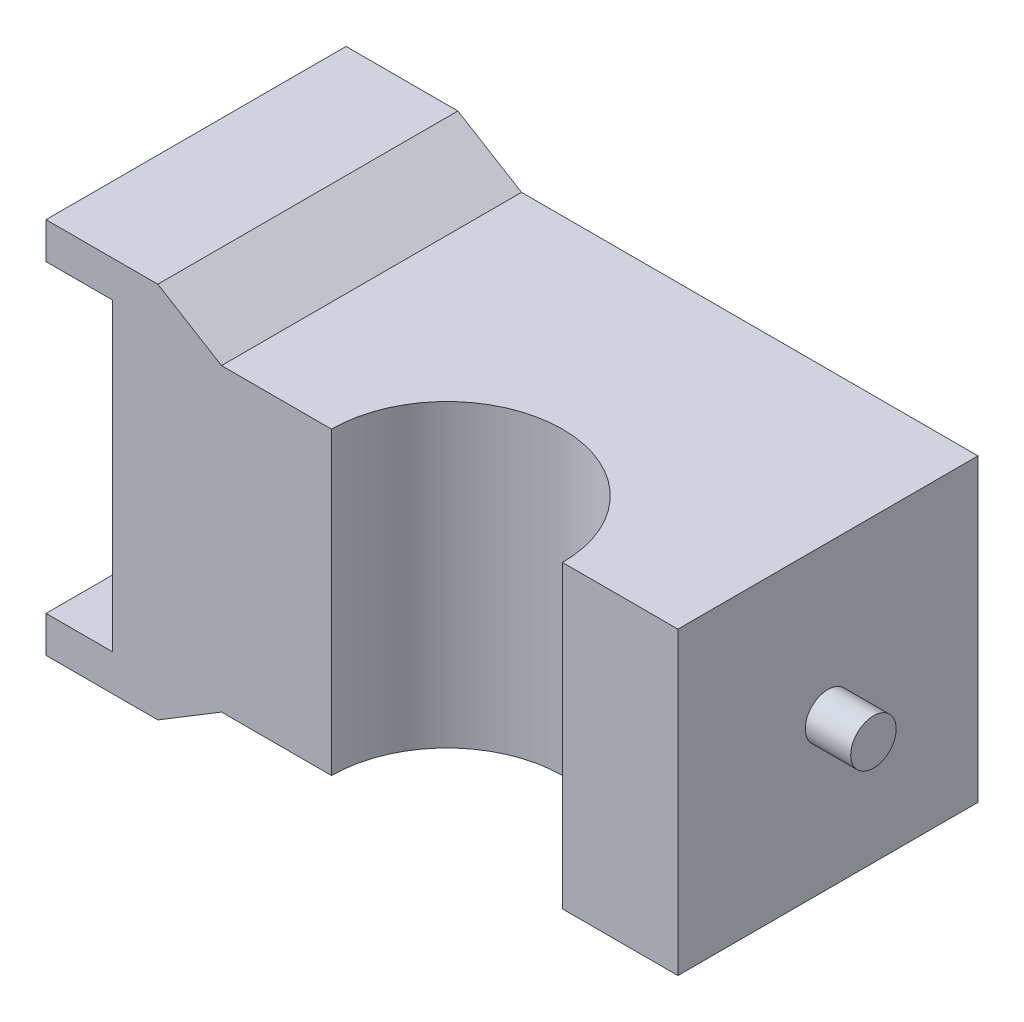
ISO-10303-21;
HEADER;
FILE_DESCRIPTION(('STEP AP214'),'2;1');
FILE_NAME('part.step','',(''),(''),'','','');
FILE_SCHEMA(('AUTOMOTIVE_DESIGN { 1 0 10303 214 1 1 1 1 }'));
ENDSEC;
DATA;
#1=APPLICATION_CONTEXT('core data for automotive mechanical design processes');
#2=APPLICATION_PROTOCOL_DEFINITION('international standard','automotive_design',2000,#1);
#3=PRODUCT_CONTEXT('',#1,'mechanical');
#4=PRODUCT('Part','Part','',(#3));
#5=PRODUCT_RELATED_PRODUCT_CATEGORY('part','',(#4));
#6=PRODUCT_DEFINITION_FORMATION('','',#4);
#7=PRODUCT_DEFINITION_CONTEXT('part definition',#1,'design');
#8=PRODUCT_DEFINITION('design','',#6,#7);
#9=PRODUCT_DEFINITION_SHAPE('','',#8);
#10=(LENGTH_UNIT() NAMED_UNIT(*) SI_UNIT(.MILLI.,.METRE.));
#11=(NAMED_UNIT(*) PLANE_ANGLE_UNIT() SI_UNIT($,.RADIAN.));
#12=(NAMED_UNIT(*) SI_UNIT($,.STERADIAN.) SOLID_ANGLE_UNIT());
#13=UNCERTAINTY_MEASURE_WITH_UNIT(LENGTH_MEASURE(1.E-05),#10,'distance_accuracy_value','');
#14=(GEOMETRIC_REPRESENTATION_CONTEXT(3) GLOBAL_UNCERTAINTY_ASSIGNED_CONTEXT((#13)) GLOBAL_UNIT_ASSIGNED_CONTEXT((#10,
#11,#12)) REPRESENTATION_CONTEXT('',''));
#15=CARTESIAN_POINT('',(0.,0.,0.));
#16=DIRECTION('',(0.,0.,1.));
#17=DIRECTION('',(1.,0.,0.));
#18=AXIS2_PLACEMENT_3D('',#15,#16,#17);
#19=CARTESIAN_POINT('',(0.,0.,16.5));
#20=DIRECTION('',(0.,0.,-1.));
#21=DIRECTION('',(-1.,0.,0.));
#22=AXIS2_PLACEMENT_3D('',#19,#20,#21);
#23=PLANE('',#22);
#24=DIRECTION('',(0.,-1.,0.));
#25=VECTOR('',#24,1.);
#26=CARTESIAN_POINT('',(12.4,20.75,16.5));
#27=LINE('',#26,#25);
#28=CARTESIAN_POINT('',(12.4,-16.5,16.5));
#29=VERTEX_POINT('',#28);
#30=CARTESIAN_POINT('',(12.4,16.5,16.5));
#31=VERTEX_POINT('',#30);
#32=EDGE_CURVE('E11',#29,#31,#27,.F.);
#33=ORIENTED_EDGE('',*,*,#32,.F.);
#34=DIRECTION('',(1.,0.,0.));
#35=VECTOR('',#34,1.);
#36=CARTESIAN_POINT('',(25.1,-16.5,16.5));
#37=LINE('',#36,#35);
#38=CARTESIAN_POINT('',(25.1,-16.5,16.5));
#39=VERTEX_POINT('',#38);
#40=EDGE_CURVE('E55',#29,#39,#37,.T.);
#41=ORIENTED_EDGE('',*,*,#40,.T.);
#42=DIRECTION('',(0.,1.,0.));
#43=VECTOR('',#42,1.);
#44=CARTESIAN_POINT('',(25.1,16.5,16.5));
#45=LINE('',#44,#43);
#46=CARTESIAN_POINT('',(25.1,16.5,16.5));
#47=VERTEX_POINT('',#46);
#48=EDGE_CURVE('E193',#39,#47,#45,.T.);
#49=ORIENTED_EDGE('',*,*,#48,.T.);
#50=DIRECTION('',(-1.,0.,0.));
#51=VECTOR('',#50,1.);
#52=CARTESIAN_POINT('',(25.1,16.5,16.5));
#53=LINE('',#52,#51);
#54=EDGE_CURVE('E109',#47,#31,#53,.T.);
#55=ORIENTED_EDGE('',*,*,#54,.T.);
#56=EDGE_LOOP('',(#33,#41,#49,#55));
#57=FACE_BOUND('',#56,.T.);
#58=ADVANCED_FACE('F32',(#57),#23,.F.);
#59=DIRECTION('',(0.,-1.,0.));
#60=VECTOR('',#59,1.);
#61=CARTESIAN_POINT('',(-13.,20.75,16.5));
#62=LINE('',#61,#60);
#63=CARTESIAN_POINT('',(-13.,16.5000000000001,16.5));
#64=VERTEX_POINT('',#63);
#65=CARTESIAN_POINT('',(-13.,-16.5,16.5));
#66=VERTEX_POINT('',#65);
#67=EDGE_CURVE('E40',#64,#66,#62,.T.);
#68=ORIENTED_EDGE('',*,*,#67,.F.);
#69=CARTESIAN_POINT('',(-25.1,16.5,16.5));
#70=VERTEX_POINT('',#69);
#71=EDGE_CURVE('E243',#64,#70,#53,.T.);
#72=ORIENTED_EDGE('',*,*,#71,.T.);
#73=DIRECTION('',(-0.854787515221729,0.518978134241763,0.));
#74=VECTOR('',#73,1.);
#75=CARTESIAN_POINT('',(-32.1,20.75,16.5));
#76=LINE('',#75,#74);
#77=CARTESIAN_POINT('',(-32.1,20.75,16.5));
#78=VERTEX_POINT('',#77);
#79=EDGE_CURVE('E245',#70,#78,#76,.T.);
#80=ORIENTED_EDGE('',*,*,#79,.T.);
#81=DIRECTION('',(-1.,0.,0.));
#82=VECTOR('',#81,1.);
#83=CARTESIAN_POINT('',(-44.4,20.75,16.5));
#84=LINE('',#83,#82);
#85=CARTESIAN_POINT('',(-44.4,20.75,16.5));
#86=VERTEX_POINT('',#85);
#87=EDGE_CURVE('E247',#78,#86,#84,.T.);
#88=ORIENTED_EDGE('',*,*,#87,.T.);
#89=DIRECTION('',(0.,-1.,0.));
#90=VECTOR('',#89,1.);
#91=CARTESIAN_POINT('',(-44.4,20.75,16.5));
#92=LINE('',#91,#90);
#93=CARTESIAN_POINT('',(-44.4,16.75,16.5));
#94=VERTEX_POINT('',#93);
#95=EDGE_CURVE('E249',#86,#94,#92,.T.);
#96=ORIENTED_EDGE('',*,*,#95,.T.);
#97=DIRECTION('',(1.,0.,0.));
#98=VECTOR('',#97,1.);
#99=CARTESIAN_POINT('',(-44.4,16.75,16.5));
#100=LINE('',#99,#98);
#101=CARTESIAN_POINT('',(-37.1,16.75,16.5));
#102=VERTEX_POINT('',#101);
#103=EDGE_CURVE('E251',#94,#102,#100,.T.);
#104=ORIENTED_EDGE('',*,*,#103,.T.);
#105=DIRECTION('',(0.,-1.,0.));
#106=VECTOR('',#105,1.);
#107=CARTESIAN_POINT('',(-37.1,16.75,16.5));
#108=LINE('',#107,#106);
#109=CARTESIAN_POINT('',(-37.1,-16.75,16.5));
#110=VERTEX_POINT('',#109);
#111=EDGE_CURVE('E253',#102,#110,#108,.T.);
#112=ORIENTED_EDGE('',*,*,#111,.T.);
#113=DIRECTION('',(-1.,0.,0.));
#114=VECTOR('',#113,1.);
#115=CARTESIAN_POINT('',(-44.4,-16.75,16.5));
#116=LINE('',#115,#114);
#117=CARTESIAN_POINT('',(-44.4,-16.75,16.5));
#118=VERTEX_POINT('',#117);
#119=EDGE_CURVE('E255',#110,#118,#116,.T.);
#120=ORIENTED_EDGE('',*,*,#119,.T.);
#121=DIRECTION('',(0.,-1.,0.));
#122=VECTOR('',#121,1.);
#123=CARTESIAN_POINT('',(-44.4,-20.75,16.5));
#124=LINE('',#123,#122);
#125=CARTESIAN_POINT('',(-44.4,-20.75,16.5));
#126=VERTEX_POINT('',#125);
#127=EDGE_CURVE('E146',#118,#126,#124,.T.);
#128=ORIENTED_EDGE('',*,*,#127,.T.);
#129=DIRECTION('',(1.,0.,0.));
#130=VECTOR('',#129,1.);
#131=CARTESIAN_POINT('',(-44.4,-20.75,16.5));
#132=LINE('',#131,#130);
#133=CARTESIAN_POINT('',(-32.1,-20.75,16.5));
#134=VERTEX_POINT('',#133);
#135=EDGE_CURVE('E138',#126,#134,#132,.T.);
#136=ORIENTED_EDGE('',*,*,#135,.T.);
#137=DIRECTION('',(0.85478751522173,0.518978134241763,0.));
#138=VECTOR('',#137,1.);
#139=CARTESIAN_POINT('',(-32.1,-20.75,16.5));
#140=LINE('',#139,#138);
#141=CARTESIAN_POINT('',(-25.1,-16.5,16.5));
#142=VERTEX_POINT('',#141);
#143=EDGE_CURVE('E143',#134,#142,#140,.T.);
#144=ORIENTED_EDGE('',*,*,#143,.T.);
#145=EDGE_CURVE('E164',#142,#66,#37,.T.);
#146=ORIENTED_EDGE('',*,*,#145,.T.);
#147=EDGE_LOOP('',(#68,#72,#80,#88,#96,#104,#112,#120,#128,#136,#144,#146));
#148=FACE_BOUND('',#147,.T.);
#149=ADVANCED_FACE('F140',(#148),#23,.F.);
#150=CARTESIAN_POINT('',(25.1,16.5,16.5));
#151=DIRECTION('',(-1.,0.,0.));
#152=DIRECTION('',(0.,-1.,0.));
#153=AXIS2_PLACEMENT_3D('',#150,#151,#152);
#154=PLANE('',#153);
#155=DIRECTION('',(0.,1.,0.));
#156=VECTOR('',#155,1.);
#157=CARTESIAN_POINT('',(25.1,16.5,-16.5));
#158=LINE('',#157,#156);
#159=CARTESIAN_POINT('',(25.1,-16.5,-16.5));
#160=VERTEX_POINT('',#159);
#161=CARTESIAN_POINT('',(25.1,16.5,-16.5));
#162=VERTEX_POINT('',#161);
#163=EDGE_CURVE('E169',#160,#162,#158,.T.);
#164=ORIENTED_EDGE('',*,*,#163,.T.);
#165=DIRECTION('',(0.,0.,-1.));
#166=VECTOR('',#165,1.);
#167=CARTESIAN_POINT('',(25.1,16.5,16.5));
#168=LINE('',#167,#166);
#169=EDGE_CURVE('E218',#47,#162,#168,.T.);
#170=ORIENTED_EDGE('',*,*,#169,.F.);
#171=ORIENTED_EDGE('',*,*,#48,.F.);
#172=DIRECTION('',(0.,0.,-1.));
#173=VECTOR('',#172,1.);
#174=CARTESIAN_POINT('',(25.1,-16.5,16.5));
#175=LINE('',#174,#173);
#176=EDGE_CURVE('E168',#39,#160,#175,.T.);
#177=ORIENTED_EDGE('',*,*,#176,.T.);
#178=EDGE_LOOP('',(#164,#170,#171,#177));
#179=FACE_BOUND('',#178,.T.);
#180=CARTESIAN_POINT('',(25.1,0.,0.));
#181=DIRECTION('',(-1.,0.,0.));
#182=DIRECTION('',(0.,-1.,0.));
#183=AXIS2_PLACEMENT_3D('',#180,#181,#182);
#184=CIRCLE('',#183,2.5);
#185=CARTESIAN_POINT('',(25.1,-2.50000000000001,0.));
#186=VERTEX_POINT('',#185);
#187=EDGE_CURVE('E223',#186,#186,#184,.F.);
#188=ORIENTED_EDGE('',*,*,#187,.F.);
#189=EDGE_LOOP('',(#188));
#190=FACE_BOUND('',#189,.T.);
#191=ADVANCED_FACE('F34',(#179,#190),#154,.F.);
#192=CARTESIAN_POINT('',(-37.1,16.75,16.5));
#193=DIRECTION('',(1.,0.,0.));
#194=DIRECTION('',(0.,1.,0.));
#195=AXIS2_PLACEMENT_3D('',#192,#193,#194);
#196=PLANE('',#195);
#197=DIRECTION('',(0.,-1.,0.));
#198=VECTOR('',#197,1.);
#199=CARTESIAN_POINT('',(-37.1,16.75,-16.5));
#200=LINE('',#199,#198);
#201=CARTESIAN_POINT('',(-37.1,16.75,-16.5));
#202=VERTEX_POINT('',#201);
#203=CARTESIAN_POINT('',(-37.1,-16.75,-16.5));
#204=VERTEX_POINT('',#203);
#205=EDGE_CURVE('E183',#202,#204,#200,.T.);
#206=ORIENTED_EDGE('',*,*,#205,.T.);
#207=DIRECTION('',(0.,0.,-1.));
#208=VECTOR('',#207,1.);
#209=CARTESIAN_POINT('',(-37.1,-16.75,16.5));
#210=LINE('',#209,#208);
#211=EDGE_CURVE('E200',#110,#204,#210,.T.);
#212=ORIENTED_EDGE('',*,*,#211,.F.);
#213=ORIENTED_EDGE('',*,*,#111,.F.);
#214=DIRECTION('',(0.,0.,-1.));
#215=VECTOR('',#214,1.);
#216=CARTESIAN_POINT('',(-37.1,16.75,16.5));
#217=LINE('',#216,#215);
#218=EDGE_CURVE('E203',#102,#202,#217,.T.);
#219=ORIENTED_EDGE('',*,*,#218,.T.);
#220=EDGE_LOOP('',(#206,#212,#213,#219));
#221=FACE_BOUND('',#220,.T.);
#222=CARTESIAN_POINT('',(-37.1,0.,0.));
#223=DIRECTION('',(1.,0.,0.));
#224=DIRECTION('',(0.,1.,0.));
#225=AXIS2_PLACEMENT_3D('',#222,#223,#224);
#226=CIRCLE('',#225,2.5);
#227=CARTESIAN_POINT('',(-37.1,2.49999999999999,0.));
#228=VERTEX_POINT('',#227);
#229=EDGE_CURVE('E220',#228,#228,#226,.F.);
#230=ORIENTED_EDGE('',*,*,#229,.F.);
#231=EDGE_LOOP('',(#230));
#232=FACE_BOUND('',#231,.T.);
#233=ADVANCED_FACE('F297',(#221,#232),#196,.F.);
#234=CARTESIAN_POINT('',(25.1,16.5,16.5));
#235=DIRECTION('',(0.,-1.,0.));
#236=DIRECTION('',(1.,0.,0.));
#237=AXIS2_PLACEMENT_3D('',#234,#235,#236);
#238=PLANE('',#237);
#239=CARTESIAN_POINT('',(-0.299999999999998,16.5,16.5));
#240=DIRECTION('',(0.,-1.,0.));
#241=DIRECTION('',(1.,0.,0.));
#242=AXIS2_PLACEMENT_3D('',#239,#240,#241);
#243=CIRCLE('',#242,12.7);
#244=EDGE_CURVE('E46',#31,#64,#243,.F.);
#245=ORIENTED_EDGE('',*,*,#244,.F.);
#246=ORIENTED_EDGE('',*,*,#54,.F.);
#247=ORIENTED_EDGE('',*,*,#169,.T.);
#248=DIRECTION('',(-1.,0.,0.));
#249=VECTOR('',#248,1.);
#250=CARTESIAN_POINT('',(25.1,16.5,-16.5));
#251=LINE('',#250,#249);
#252=CARTESIAN_POINT('',(-25.1,16.5,-16.5));
#253=VERTEX_POINT('',#252);
#254=EDGE_CURVE('E172',#162,#253,#251,.T.);
#255=ORIENTED_EDGE('',*,*,#254,.T.);
#256=DIRECTION('',(0.,0.,-1.));
#257=VECTOR('',#256,1.);
#258=CARTESIAN_POINT('',(-25.1,16.5,16.5));
#259=LINE('',#258,#257);
#260=EDGE_CURVE('E215',#70,#253,#259,.T.);
#261=ORIENTED_EDGE('',*,*,#260,.F.);
#262=ORIENTED_EDGE('',*,*,#71,.F.);
#263=EDGE_LOOP('',(#245,#246,#247,#255,#261,#262));
#264=FACE_BOUND('',#263,.T.);
#265=ADVANCED_FACE('F274',(#264),#238,.F.);
#266=CARTESIAN_POINT('',(-32.1,20.75,16.5));
#267=DIRECTION('',(-0.518978134241763,-0.854787515221729,0.));
#268=DIRECTION('',(0.85478751522173,-0.518978134241763,0.));
#269=AXIS2_PLACEMENT_3D('',#266,#267,#268);
#270=PLANE('',#269);
#271=DIRECTION('',(-0.854787515221729,0.518978134241763,0.));
#272=VECTOR('',#271,1.);
#273=CARTESIAN_POINT('',(-32.1,20.75,-16.5));
#274=LINE('',#273,#272);
#275=CARTESIAN_POINT('',(-32.1,20.75,-16.5));
#276=VERTEX_POINT('',#275);
#277=EDGE_CURVE('E175',#253,#276,#274,.T.);
#278=ORIENTED_EDGE('',*,*,#277,.T.);
#279=DIRECTION('',(0.,0.,-1.));
#280=VECTOR('',#279,1.);
#281=CARTESIAN_POINT('',(-32.1,20.75,16.5));
#282=LINE('',#281,#280);
#283=EDGE_CURVE('E212',#78,#276,#282,.T.);
#284=ORIENTED_EDGE('',*,*,#283,.F.);
#285=ORIENTED_EDGE('',*,*,#79,.F.);
#286=ORIENTED_EDGE('',*,*,#260,.T.);
#287=EDGE_LOOP('',(#278,#284,#285,#286));
#288=FACE_BOUND('',#287,.T.);
#289=ADVANCED_FACE('F281',(#288),#270,.F.);
#290=CARTESIAN_POINT('',(-44.4,20.75,16.5));
#291=DIRECTION('',(0.,-1.,0.));
#292=DIRECTION('',(1.,0.,0.));
#293=AXIS2_PLACEMENT_3D('',#290,#291,#292);
#294=PLANE('',#293);
#295=DIRECTION('',(-1.,0.,0.));
#296=VECTOR('',#295,1.);
#297=CARTESIAN_POINT('',(-44.4,20.75,-16.5));
#298=LINE('',#297,#296);
#299=CARTESIAN_POINT('',(-44.4,20.75,-16.5));
#300=VERTEX_POINT('',#299);
#301=EDGE_CURVE('E177',#276,#300,#298,.T.);
#302=ORIENTED_EDGE('',*,*,#301,.T.);
#303=DIRECTION('',(0.,0.,-1.));
#304=VECTOR('',#303,1.);
#305=CARTESIAN_POINT('',(-44.4,20.75,16.5));
#306=LINE('',#305,#304);
#307=EDGE_CURVE('E209',#86,#300,#306,.T.);
#308=ORIENTED_EDGE('',*,*,#307,.F.);
#309=ORIENTED_EDGE('',*,*,#87,.F.);
#310=ORIENTED_EDGE('',*,*,#283,.T.);
#311=EDGE_LOOP('',(#302,#308,#309,#310));
#312=FACE_BOUND('',#311,.T.);
#313=ADVANCED_FACE('F284',(#312),#294,.F.);
#314=CARTESIAN_POINT('',(-44.4,20.75,16.5));
#315=DIRECTION('',(1.,0.,0.));
#316=DIRECTION('',(0.,1.,0.));
#317=AXIS2_PLACEMENT_3D('',#314,#315,#316);
#318=PLANE('',#317);
#319=DIRECTION('',(0.,-1.,0.));
#320=VECTOR('',#319,1.);
#321=CARTESIAN_POINT('',(-44.4,20.75,-16.5));
#322=LINE('',#321,#320);
#323=CARTESIAN_POINT('',(-44.4,16.75,-16.5));
#324=VERTEX_POINT('',#323);
#325=EDGE_CURVE('E179',#300,#324,#322,.T.);
#326=ORIENTED_EDGE('',*,*,#325,.T.);
#327=DIRECTION('',(0.,0.,-1.));
#328=VECTOR('',#327,1.);
#329=CARTESIAN_POINT('',(-44.4,16.75,16.5));
#330=LINE('',#329,#328);
#331=EDGE_CURVE('E206',#94,#324,#330,.T.);
#332=ORIENTED_EDGE('',*,*,#331,.F.);
#333=ORIENTED_EDGE('',*,*,#95,.F.);
#334=ORIENTED_EDGE('',*,*,#307,.T.);
#335=EDGE_LOOP('',(#326,#332,#333,#334));
#336=FACE_BOUND('',#335,.T.);
#337=ADVANCED_FACE('F289',(#336),#318,.F.);
#338=CARTESIAN_POINT('',(-44.4,16.75,16.5));
#339=DIRECTION('',(0.,1.,0.));
#340=DIRECTION('',(-1.,0.,0.));
#341=AXIS2_PLACEMENT_3D('',#338,#339,#340);
#342=PLANE('',#341);
#343=DIRECTION('',(1.,0.,0.));
#344=VECTOR('',#343,1.);
#345=CARTESIAN_POINT('',(-44.4,16.75,-16.5));
#346=LINE('',#345,#344);
#347=EDGE_CURVE('E181',#324,#202,#346,.T.);
#348=ORIENTED_EDGE('',*,*,#347,.T.);
#349=ORIENTED_EDGE('',*,*,#218,.F.);
#350=ORIENTED_EDGE('',*,*,#103,.F.);
#351=ORIENTED_EDGE('',*,*,#331,.T.);
#352=EDGE_LOOP('',(#348,#349,#350,#351));
#353=FACE_BOUND('',#352,.T.);
#354=ADVANCED_FACE('F293',(#353),#342,.F.);
#355=CARTESIAN_POINT('',(-44.4,-16.75,16.5));
#356=DIRECTION('',(0.,-1.,0.));
#357=DIRECTION('',(1.,0.,0.));
#358=AXIS2_PLACEMENT_3D('',#355,#356,#357);
#359=PLANE('',#358);
#360=DIRECTION('',(-1.,0.,0.));
#361=VECTOR('',#360,1.);
#362=CARTESIAN_POINT('',(-44.4,-16.75,-16.5));
#363=LINE('',#362,#361);
#364=CARTESIAN_POINT('',(-44.4,-16.75,-16.5));
#365=VERTEX_POINT('',#364);
#366=EDGE_CURVE('E185',#204,#365,#363,.T.);
#367=ORIENTED_EDGE('',*,*,#366,.T.);
#368=DIRECTION('',(0.,0.,-1.));
#369=VECTOR('',#368,1.);
#370=CARTESIAN_POINT('',(-44.4,-16.75,16.5));
#371=LINE('',#370,#369);
#372=EDGE_CURVE('E197',#118,#365,#371,.T.);
#373=ORIENTED_EDGE('',*,*,#372,.F.);
#374=ORIENTED_EDGE('',*,*,#119,.F.);
#375=ORIENTED_EDGE('',*,*,#211,.T.);
#376=EDGE_LOOP('',(#367,#373,#374,#375));
#377=FACE_BOUND('',#376,.T.);
#378=ADVANCED_FACE('F261',(#377),#359,.F.);
#379=CARTESIAN_POINT('',(-44.4,-20.75,16.5));
#380=DIRECTION('',(1.,0.,0.));
#381=DIRECTION('',(0.,1.,0.));
#382=AXIS2_PLACEMENT_3D('',#379,#380,#381);
#383=PLANE('',#382);
#384=DIRECTION('',(0.,-1.,0.));
#385=VECTOR('',#384,1.);
#386=CARTESIAN_POINT('',(-44.4,-20.75,-16.5));
#387=LINE('',#386,#385);
#388=CARTESIAN_POINT('',(-44.4,-20.75,-16.5));
#389=VERTEX_POINT('',#388);
#390=EDGE_CURVE('E187',#365,#389,#387,.T.);
#391=ORIENTED_EDGE('',*,*,#390,.T.);
#392=DIRECTION('',(0.,0.,-1.));
#393=VECTOR('',#392,1.);
#394=CARTESIAN_POINT('',(-44.4,-20.75,16.5));
#395=LINE('',#394,#393);
#396=EDGE_CURVE('E158',#126,#389,#395,.T.);
#397=ORIENTED_EDGE('',*,*,#396,.F.);
#398=ORIENTED_EDGE('',*,*,#127,.F.);
#399=ORIENTED_EDGE('',*,*,#372,.T.);
#400=EDGE_LOOP('',(#391,#397,#398,#399));
#401=FACE_BOUND('',#400,.T.);
#402=ADVANCED_FACE('F265',(#401),#383,.F.);
#403=CARTESIAN_POINT('',(-44.4,-20.75,16.5));
#404=DIRECTION('',(0.,1.,0.));
#405=DIRECTION('',(-1.,0.,0.));
#406=AXIS2_PLACEMENT_3D('',#403,#404,#405);
#407=PLANE('',#406);
#408=DIRECTION('',(1.,0.,0.));
#409=VECTOR('',#408,1.);
#410=CARTESIAN_POINT('',(-44.4,-20.75,-16.5));
#411=LINE('',#410,#409);
#412=CARTESIAN_POINT('',(-32.1,-20.75,-16.5));
#413=VERTEX_POINT('',#412);
#414=EDGE_CURVE('E155',#389,#413,#411,.T.);
#415=ORIENTED_EDGE('',*,*,#414,.T.);
#416=DIRECTION('',(0.,0.,-1.));
#417=VECTOR('',#416,1.);
#418=CARTESIAN_POINT('',(-32.1,-20.75,16.5));
#419=LINE('',#418,#417);
#420=EDGE_CURVE('E152',#134,#413,#419,.T.);
#421=ORIENTED_EDGE('',*,*,#420,.F.);
#422=ORIENTED_EDGE('',*,*,#135,.F.);
#423=ORIENTED_EDGE('',*,*,#396,.T.);
#424=EDGE_LOOP('',(#415,#421,#422,#423));
#425=FACE_BOUND('',#424,.T.);
#426=ADVANCED_FACE('F153',(#425),#407,.F.);
#427=CARTESIAN_POINT('',(-32.1,-20.75,16.5));
#428=DIRECTION('',(-0.518978134241763,0.854787515221729,0.));
#429=DIRECTION('',(-0.85478751522173,-0.518978134241763,0.));
#430=AXIS2_PLACEMENT_3D('',#427,#428,#429);
#431=PLANE('',#430);
#432=DIRECTION('',(0.85478751522173,0.518978134241763,0.));
#433=VECTOR('',#432,1.);
#434=CARTESIAN_POINT('',(-32.1,-20.75,-16.5));
#435=LINE('',#434,#433);
#436=CARTESIAN_POINT('',(-25.1,-16.5,-16.5));
#437=VERTEX_POINT('',#436);
#438=EDGE_CURVE('E190',#413,#437,#435,.T.);
#439=ORIENTED_EDGE('',*,*,#438,.T.);
#440=DIRECTION('',(0.,0.,-1.));
#441=VECTOR('',#440,1.);
#442=CARTESIAN_POINT('',(-25.1,-16.5,16.5));
#443=LINE('',#442,#441);
#444=EDGE_CURVE('E159',#142,#437,#443,.T.);
#445=ORIENTED_EDGE('',*,*,#444,.F.);
#446=ORIENTED_EDGE('',*,*,#143,.F.);
#447=ORIENTED_EDGE('',*,*,#420,.T.);
#448=EDGE_LOOP('',(#439,#445,#446,#447));
#449=FACE_BOUND('',#448,.T.);
#450=ADVANCED_FACE('F161',(#449),#431,.F.);
#451=CARTESIAN_POINT('',(25.1,-16.5,16.5));
#452=DIRECTION('',(0.,1.,0.));
#453=DIRECTION('',(0.,0.,1.));
#454=AXIS2_PLACEMENT_3D('',#451,#452,#453);
#455=PLANE('',#454);
#456=CARTESIAN_POINT('',(-0.299999999999998,-16.5,16.5));
#457=DIRECTION('',(0.,1.,0.));
#458=DIRECTION('',(0.,0.,1.));
#459=AXIS2_PLACEMENT_3D('',#456,#457,#458);
#460=CIRCLE('',#459,12.7);
#461=EDGE_CURVE('E230',#66,#29,#460,.F.);
#462=ORIENTED_EDGE('',*,*,#461,.F.);
#463=ORIENTED_EDGE('',*,*,#145,.F.);
#464=ORIENTED_EDGE('',*,*,#444,.T.);
#465=DIRECTION('',(1.,0.,0.));
#466=VECTOR('',#465,1.);
#467=CARTESIAN_POINT('',(25.1,-16.5,-16.5));
#468=LINE('',#467,#466);
#469=EDGE_CURVE('E101',#437,#160,#468,.T.);
#470=ORIENTED_EDGE('',*,*,#469,.T.);
#471=ORIENTED_EDGE('',*,*,#176,.F.);
#472=ORIENTED_EDGE('',*,*,#40,.F.);
#473=EDGE_LOOP('',(#462,#463,#464,#470,#471,#472));
#474=FACE_BOUND('',#473,.T.);
#475=ADVANCED_FACE('F233',(#474),#455,.F.);
#476=CARTESIAN_POINT('',(0.,0.,-16.5));
#477=DIRECTION('',(0.,0.,-1.));
#478=DIRECTION('',(-1.,0.,0.));
#479=AXIS2_PLACEMENT_3D('',#476,#477,#478);
#480=PLANE('',#479);
#481=ORIENTED_EDGE('',*,*,#163,.F.);
#482=ORIENTED_EDGE('',*,*,#469,.F.);
#483=ORIENTED_EDGE('',*,*,#438,.F.);
#484=ORIENTED_EDGE('',*,*,#414,.F.);
#485=ORIENTED_EDGE('',*,*,#390,.F.);
#486=ORIENTED_EDGE('',*,*,#366,.F.);
#487=ORIENTED_EDGE('',*,*,#205,.F.);
#488=ORIENTED_EDGE('',*,*,#347,.F.);
#489=ORIENTED_EDGE('',*,*,#325,.F.);
#490=ORIENTED_EDGE('',*,*,#301,.F.);
#491=ORIENTED_EDGE('',*,*,#277,.F.);
#492=ORIENTED_EDGE('',*,*,#254,.F.);
#493=EDGE_LOOP('',(#481,#482,#483,#484,#485,#486,#487,#488,#489,#490,#491,#492));
#494=FACE_BOUND('',#493,.T.);
#495=ADVANCED_FACE('F268',(#494),#480,.T.);
#496=CARTESIAN_POINT('',(-42.1,0.,0.));
#497=DIRECTION('',(1.,0.,0.));
#498=DIRECTION('',(0.,0.,-1.));
#499=AXIS2_PLACEMENT_3D('',#496,#497,#498);
#500=CYLINDRICAL_SURFACE('',#499,2.5);
#501=CARTESIAN_POINT('',(-42.1,0.,0.));
#502=DIRECTION('',(-1.,0.,0.));
#503=DIRECTION('',(0.,0.,1.));
#504=AXIS2_PLACEMENT_3D('',#501,#502,#503);
#505=CIRCLE('',#504,2.5);
#506=CARTESIAN_POINT('',(-42.1,0.,2.5));
#507=VERTEX_POINT('',#506);
#508=EDGE_CURVE('E173',#507,#507,#505,.T.);
#509=ORIENTED_EDGE('',*,*,#508,.F.);
#510=EDGE_LOOP('',(#509));
#511=FACE_BOUND('',#510,.T.);
#512=ORIENTED_EDGE('',*,*,#229,.T.);
#513=EDGE_LOOP('',(#512));
#514=FACE_BOUND('',#513,.T.);
#515=ADVANCED_FACE('F303',(#511,#514),#500,.T.);
#516=CARTESIAN_POINT('',(-42.1,0.,0.));
#517=DIRECTION('',(-1.,0.,0.));
#518=DIRECTION('',(0.,0.,1.));
#519=AXIS2_PLACEMENT_3D('',#516,#517,#518);
#520=PLANE('',#519);
#521=ORIENTED_EDGE('',*,*,#508,.T.);
#522=EDGE_LOOP('',(#521));
#523=FACE_BOUND('',#522,.T.);
#524=ADVANCED_FACE('F305',(#523),#520,.T.);
#525=CARTESIAN_POINT('',(30.1,0.,0.));
#526=DIRECTION('',(-1.,0.,0.));
#527=DIRECTION('',(0.,-1.,0.));
#528=AXIS2_PLACEMENT_3D('',#525,#526,#527);
#529=CYLINDRICAL_SURFACE('',#528,2.5);
#530=CARTESIAN_POINT('',(30.1,0.,0.));
#531=DIRECTION('',(1.,0.,0.));
#532=DIRECTION('',(0.,1.,0.));
#533=AXIS2_PLACEMENT_3D('',#530,#531,#532);
#534=CIRCLE('',#533,2.5);
#535=CARTESIAN_POINT('',(30.1,2.49999999999999,0.));
#536=VERTEX_POINT('',#535);
#537=EDGE_CURVE('E235',#536,#536,#534,.T.);
#538=ORIENTED_EDGE('',*,*,#537,.F.);
#539=EDGE_LOOP('',(#538));
#540=FACE_BOUND('',#539,.T.);
#541=ORIENTED_EDGE('',*,*,#187,.T.);
#542=EDGE_LOOP('',(#541));
#543=FACE_BOUND('',#542,.T.);
#544=ADVANCED_FACE('F312',(#540,#543),#529,.T.);
#545=CARTESIAN_POINT('',(30.1,0.,0.));
#546=DIRECTION('',(1.,0.,0.));
#547=DIRECTION('',(0.,1.,0.));
#548=AXIS2_PLACEMENT_3D('',#545,#546,#547);
#549=PLANE('',#548);
#550=ORIENTED_EDGE('',*,*,#537,.T.);
#551=EDGE_LOOP('',(#550));
#552=FACE_BOUND('',#551,.T.);
#553=ADVANCED_FACE('F408',(#552),#549,.T.);
#554=CARTESIAN_POINT('',(-0.299999999999998,20.75,16.5));
#555=DIRECTION('',(0.,-1.,0.));
#556=DIRECTION('',(0.,0.,-1.));
#557=AXIS2_PLACEMENT_3D('',#554,#555,#556);
#558=CYLINDRICAL_SURFACE('',#557,12.7);
#559=ORIENTED_EDGE('',*,*,#32,.T.);
#560=ORIENTED_EDGE('',*,*,#244,.T.);
#561=ORIENTED_EDGE('',*,*,#67,.T.);
#562=ORIENTED_EDGE('',*,*,#461,.T.);
#563=EDGE_LOOP('',(#559,#560,#561,#562));
#564=FACE_BOUND('',#563,.T.);
#565=ADVANCED_FACE('F228',(#564),#558,.F.);
#566=CLOSED_SHELL('',(#58,#149,#191,#233,#265,#289,#313,#337,#354,#378,#402,#426,#450,#475,#495,
#515,#524,#544,#553,#565));
#567=MANIFOLD_SOLID_BREP('B2',#566);
#568=ADVANCED_BREP_SHAPE_REPRESENTATION('',(#18,#567),#14);
#569=SHAPE_DEFINITION_REPRESENTATION(#9,#568);
ENDSEC;
END-ISO-10303-21;
